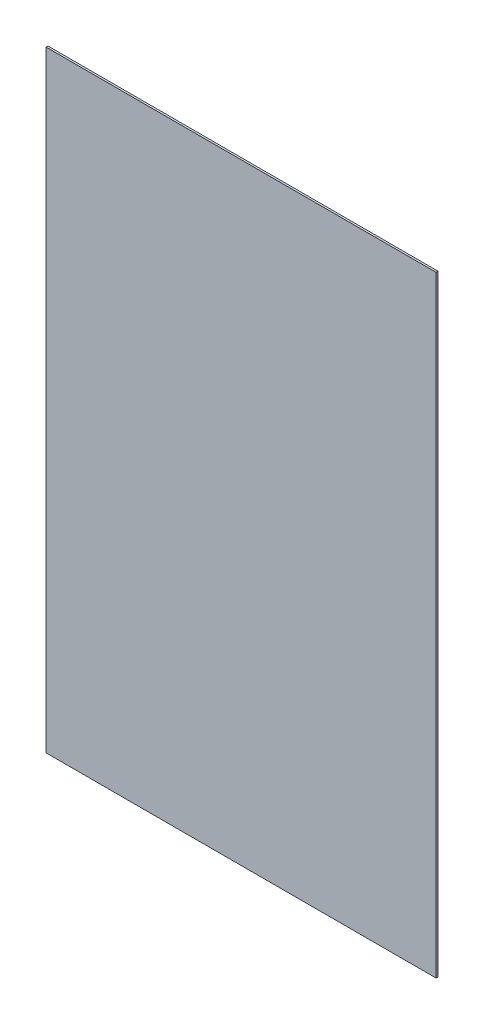
ISO-10303-21;
HEADER;
FILE_DESCRIPTION(('STEP AP214'),'2;1');
FILE_NAME('part.step','',(''),(''),'','','');
FILE_SCHEMA(('AUTOMOTIVE_DESIGN { 1 0 10303 214 1 1 1 1 }'));
ENDSEC;
DATA;
#1=APPLICATION_CONTEXT('core data for automotive mechanical design processes');
#2=APPLICATION_PROTOCOL_DEFINITION('international standard','automotive_design',2000,#1);
#3=PRODUCT_CONTEXT('',#1,'mechanical');
#4=PRODUCT('Part','Part','',(#3));
#5=PRODUCT_RELATED_PRODUCT_CATEGORY('part','',(#4));
#6=PRODUCT_DEFINITION_FORMATION('','',#4);
#7=PRODUCT_DEFINITION_CONTEXT('part definition',#1,'design');
#8=PRODUCT_DEFINITION('design','',#6,#7);
#9=PRODUCT_DEFINITION_SHAPE('','',#8);
#10=(LENGTH_UNIT() NAMED_UNIT(*) SI_UNIT(.MILLI.,.METRE.));
#11=(NAMED_UNIT(*) PLANE_ANGLE_UNIT() SI_UNIT($,.RADIAN.));
#12=(NAMED_UNIT(*) SI_UNIT($,.STERADIAN.) SOLID_ANGLE_UNIT());
#13=UNCERTAINTY_MEASURE_WITH_UNIT(LENGTH_MEASURE(1.E-05),#10,'distance_accuracy_value','');
#14=(GEOMETRIC_REPRESENTATION_CONTEXT(3) GLOBAL_UNCERTAINTY_ASSIGNED_CONTEXT((#13)) GLOBAL_UNIT_ASSIGNED_CONTEXT((#10,
#11,#12)) REPRESENTATION_CONTEXT('',''));
#15=CARTESIAN_POINT('',(0.,0.,0.));
#16=DIRECTION('',(0.,0.,1.));
#17=DIRECTION('',(1.,0.,0.));
#18=AXIS2_PLACEMENT_3D('',#15,#16,#17);
#19=CARTESIAN_POINT('',(-500.,783.874999999999,2.5));
#20=DIRECTION('',(1.,0.,0.));
#21=DIRECTION('',(0.,1.,0.));
#22=AXIS2_PLACEMENT_3D('',#19,#20,#21);
#23=PLANE('',#22);
#24=DIRECTION('',(0.,-1.,0.));
#25=VECTOR('',#24,1.);
#26=CARTESIAN_POINT('',(-500.,783.874999999999,-2.5));
#27=LINE('',#26,#25);
#28=CARTESIAN_POINT('',(-500.,783.874999999999,-2.5));
#29=VERTEX_POINT('',#28);
#30=CARTESIAN_POINT('',(-500.,-783.875,-2.5));
#31=VERTEX_POINT('',#30);
#32=EDGE_CURVE('E107',#29,#31,#27,.T.);
#33=ORIENTED_EDGE('',*,*,#32,.T.);
#34=DIRECTION('',(0.,0.,-1.));
#35=VECTOR('',#34,1.);
#36=CARTESIAN_POINT('',(-500.,-783.875,2.5));
#37=LINE('',#36,#35);
#38=CARTESIAN_POINT('',(-500.,-783.875,2.5));
#39=VERTEX_POINT('',#38);
#40=EDGE_CURVE('E11',#39,#31,#37,.T.);
#41=ORIENTED_EDGE('',*,*,#40,.F.);
#42=DIRECTION('',(0.,-1.,0.));
#43=VECTOR('',#42,1.);
#44=CARTESIAN_POINT('',(-500.,783.874999999999,2.5));
#45=LINE('',#44,#43);
#46=CARTESIAN_POINT('',(-500.,783.874999999999,2.5));
#47=VERTEX_POINT('',#46);
#48=EDGE_CURVE('E91',#47,#39,#45,.T.);
#49=ORIENTED_EDGE('',*,*,#48,.F.);
#50=DIRECTION('',(0.,0.,-1.));
#51=VECTOR('',#50,1.);
#52=CARTESIAN_POINT('',(-500.,783.874999999999,2.5));
#53=LINE('',#52,#51);
#54=EDGE_CURVE('E103',#47,#29,#53,.T.);
#55=ORIENTED_EDGE('',*,*,#54,.T.);
#56=EDGE_LOOP('',(#33,#41,#49,#55));
#57=FACE_BOUND('',#56,.T.);
#58=ADVANCED_FACE('F39',(#57),#23,.F.);
#59=CARTESIAN_POINT('',(500.,-783.875,2.5));
#60=DIRECTION('',(0.,1.,0.));
#61=DIRECTION('',(0.,0.,1.));
#62=AXIS2_PLACEMENT_3D('',#59,#60,#61);
#63=PLANE('',#62);
#64=DIRECTION('',(1.,0.,0.));
#65=VECTOR('',#64,1.);
#66=CARTESIAN_POINT('',(500.,-783.875,-2.5));
#67=LINE('',#66,#65);
#68=CARTESIAN_POINT('',(500.,-783.875,-2.5));
#69=VERTEX_POINT('',#68);
#70=EDGE_CURVE('E96',#31,#69,#67,.T.);
#71=ORIENTED_EDGE('',*,*,#70,.T.);
#72=DIRECTION('',(0.,0.,-1.));
#73=VECTOR('',#72,1.);
#74=CARTESIAN_POINT('',(500.,-783.875,2.5));
#75=LINE('',#74,#73);
#76=CARTESIAN_POINT('',(500.,-783.875,2.5));
#77=VERTEX_POINT('',#76);
#78=EDGE_CURVE('E48',#77,#69,#75,.T.);
#79=ORIENTED_EDGE('',*,*,#78,.F.);
#80=DIRECTION('',(1.,0.,0.));
#81=VECTOR('',#80,1.);
#82=CARTESIAN_POINT('',(500.,-783.875,2.5));
#83=LINE('',#82,#81);
#84=EDGE_CURVE('E86',#39,#77,#83,.T.);
#85=ORIENTED_EDGE('',*,*,#84,.F.);
#86=ORIENTED_EDGE('',*,*,#40,.T.);
#87=EDGE_LOOP('',(#71,#79,#85,#86));
#88=FACE_BOUND('',#87,.T.);
#89=ADVANCED_FACE('F95',(#88),#63,.F.);
#90=CARTESIAN_POINT('',(500.,783.875,2.5));
#91=DIRECTION('',(-1.,0.,0.));
#92=DIRECTION('',(0.,-1.,0.));
#93=AXIS2_PLACEMENT_3D('',#90,#91,#92);
#94=PLANE('',#93);
#95=DIRECTION('',(0.,1.,0.));
#96=VECTOR('',#95,1.);
#97=CARTESIAN_POINT('',(500.,783.875,-2.5));
#98=LINE('',#97,#96);
#99=CARTESIAN_POINT('',(500.,783.875,-2.5));
#100=VERTEX_POINT('',#99);
#101=EDGE_CURVE('E73',#69,#100,#98,.T.);
#102=ORIENTED_EDGE('',*,*,#101,.T.);
#103=DIRECTION('',(0.,0.,-1.));
#104=VECTOR('',#103,1.);
#105=CARTESIAN_POINT('',(500.,783.875,2.5));
#106=LINE('',#105,#104);
#107=CARTESIAN_POINT('',(500.,783.875,2.5));
#108=VERTEX_POINT('',#107);
#109=EDGE_CURVE('E98',#108,#100,#106,.T.);
#110=ORIENTED_EDGE('',*,*,#109,.F.);
#111=DIRECTION('',(0.,1.,0.));
#112=VECTOR('',#111,1.);
#113=CARTESIAN_POINT('',(500.,783.875,2.5));
#114=LINE('',#113,#112);
#115=EDGE_CURVE('E89',#77,#108,#114,.T.);
#116=ORIENTED_EDGE('',*,*,#115,.F.);
#117=ORIENTED_EDGE('',*,*,#78,.T.);
#118=EDGE_LOOP('',(#102,#110,#116,#117));
#119=FACE_BOUND('',#118,.T.);
#120=ADVANCED_FACE('F99',(#119),#94,.F.);
#121=CARTESIAN_POINT('',(500.,783.875,2.5));
#122=DIRECTION('',(0.,-1.,0.));
#123=DIRECTION('',(1.,0.,0.));
#124=AXIS2_PLACEMENT_3D('',#121,#122,#123);
#125=PLANE('',#124);
#126=DIRECTION('',(-1.,0.,0.));
#127=VECTOR('',#126,1.);
#128=CARTESIAN_POINT('',(500.,783.875,-2.5));
#129=LINE('',#128,#127);
#130=EDGE_CURVE('E79',#100,#29,#129,.T.);
#131=ORIENTED_EDGE('',*,*,#130,.T.);
#132=ORIENTED_EDGE('',*,*,#54,.F.);
#133=DIRECTION('',(-1.,0.,0.));
#134=VECTOR('',#133,1.);
#135=CARTESIAN_POINT('',(500.,783.875,2.5));
#136=LINE('',#135,#134);
#137=EDGE_CURVE('E56',#108,#47,#136,.T.);
#138=ORIENTED_EDGE('',*,*,#137,.F.);
#139=ORIENTED_EDGE('',*,*,#109,.T.);
#140=EDGE_LOOP('',(#131,#132,#138,#139));
#141=FACE_BOUND('',#140,.T.);
#142=ADVANCED_FACE('F120',(#141),#125,.F.);
#143=CARTESIAN_POINT('',(0.,0.,2.5));
#144=DIRECTION('',(0.,0.,-1.));
#145=DIRECTION('',(-1.,0.,0.));
#146=AXIS2_PLACEMENT_3D('',#143,#144,#145);
#147=PLANE('',#146);
#148=ORIENTED_EDGE('',*,*,#48,.T.);
#149=ORIENTED_EDGE('',*,*,#84,.T.);
#150=ORIENTED_EDGE('',*,*,#115,.T.);
#151=ORIENTED_EDGE('',*,*,#137,.T.);
#152=EDGE_LOOP('',(#148,#149,#150,#151));
#153=FACE_BOUND('',#152,.T.);
#154=ADVANCED_FACE('F87',(#153),#147,.F.);
#155=CARTESIAN_POINT('',(0.,0.,-2.5));
#156=DIRECTION('',(0.,0.,-1.));
#157=DIRECTION('',(-1.,0.,0.));
#158=AXIS2_PLACEMENT_3D('',#155,#156,#157);
#159=PLANE('',#158);
#160=ORIENTED_EDGE('',*,*,#32,.F.);
#161=ORIENTED_EDGE('',*,*,#130,.F.);
#162=ORIENTED_EDGE('',*,*,#101,.F.);
#163=ORIENTED_EDGE('',*,*,#70,.F.);
#164=EDGE_LOOP('',(#160,#161,#162,#163));
#165=FACE_BOUND('',#164,.T.);
#166=ADVANCED_FACE('F123',(#165),#159,.T.);
#167=CLOSED_SHELL('',(#58,#89,#120,#142,#154,#166));
#168=MANIFOLD_SOLID_BREP('B2',#167);
#169=ADVANCED_BREP_SHAPE_REPRESENTATION('',(#18,#168),#14);
#170=SHAPE_DEFINITION_REPRESENTATION(#9,#169);
ENDSEC;
END-ISO-10303-21;
